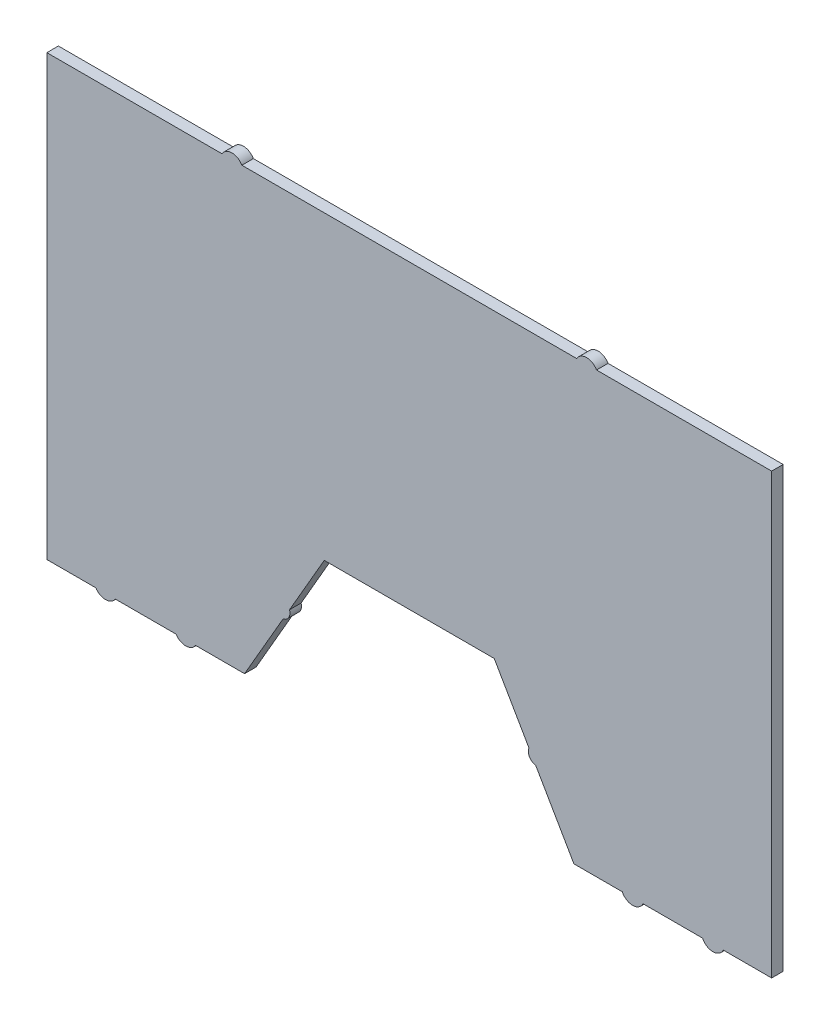
ISO-10303-21;
HEADER;
FILE_DESCRIPTION(('STEP AP214'),'2;1');
FILE_NAME('part.step','',(''),(''),'','','');
FILE_SCHEMA(('AUTOMOTIVE_DESIGN { 1 0 10303 214 1 1 1 1 }'));
ENDSEC;
DATA;
#1=APPLICATION_CONTEXT('core data for automotive mechanical design processes');
#2=APPLICATION_PROTOCOL_DEFINITION('international standard','automotive_design',2000,#1);
#3=PRODUCT_CONTEXT('',#1,'mechanical');
#4=PRODUCT('Part','Part','',(#3));
#5=PRODUCT_RELATED_PRODUCT_CATEGORY('part','',(#4));
#6=PRODUCT_DEFINITION_FORMATION('','',#4);
#7=PRODUCT_DEFINITION_CONTEXT('part definition',#1,'design');
#8=PRODUCT_DEFINITION('design','',#6,#7);
#9=PRODUCT_DEFINITION_SHAPE('','',#8);
#10=(LENGTH_UNIT() NAMED_UNIT(*) SI_UNIT(.MILLI.,.METRE.));
#11=(NAMED_UNIT(*) PLANE_ANGLE_UNIT() SI_UNIT($,.RADIAN.));
#12=(NAMED_UNIT(*) SI_UNIT($,.STERADIAN.) SOLID_ANGLE_UNIT());
#13=UNCERTAINTY_MEASURE_WITH_UNIT(LENGTH_MEASURE(1.E-05),#10,'distance_accuracy_value','');
#14=(GEOMETRIC_REPRESENTATION_CONTEXT(3) GLOBAL_UNCERTAINTY_ASSIGNED_CONTEXT((#13)) GLOBAL_UNIT_ASSIGNED_CONTEXT((#10,
#11,#12)) REPRESENTATION_CONTEXT('',''));
#15=CARTESIAN_POINT('',(0.,0.,0.));
#16=DIRECTION('',(0.,0.,1.));
#17=DIRECTION('',(1.,0.,0.));
#18=AXIS2_PLACEMENT_3D('',#15,#16,#17);
#19=CARTESIAN_POINT('',(-119.213610054364,-38.92969826474,5.));
#20=DIRECTION('',(0.,0.,-1.));
#21=DIRECTION('',(-1.,0.,0.));
#22=AXIS2_PLACEMENT_3D('',#19,#20,#21);
#23=CYLINDRICAL_SURFACE('',#22,4.99999999999952);
#24=CARTESIAN_POINT('',(-119.213610054364,-38.92969826474,0.));
#25=DIRECTION('',(0.,0.,1.));
#26=DIRECTION('',(1.,0.,0.));
#27=AXIS2_PLACEMENT_3D('',#24,#25,#26);
#28=CIRCLE('',#27,4.99999999999952);
#29=CARTESIAN_POINT('',(-123.443790440154,-41.5953265028237,0.));
#30=VERTEX_POINT('',#29);
#31=CARTESIAN_POINT('',(-114.983429668575,-41.5953265028263,0.));
#32=VERTEX_POINT('',#31);
#33=EDGE_CURVE('E225',#30,#32,#28,.T.);
#34=ORIENTED_EDGE('',*,*,#33,.T.);
#35=DIRECTION('',(0.,0.,-1.));
#36=VECTOR('',#35,1.);
#37=CARTESIAN_POINT('',(-114.983429668575,-41.5953265028263,5.));
#38=LINE('',#37,#36);
#39=CARTESIAN_POINT('',(-114.983429668575,-41.5953265028263,5.));
#40=VERTEX_POINT('',#39);
#41=EDGE_CURVE('E11',#40,#32,#38,.T.);
#42=ORIENTED_EDGE('',*,*,#41,.F.);
#43=CARTESIAN_POINT('',(-119.213610054364,-38.92969826474,5.));
#44=DIRECTION('',(0.,0.,1.));
#45=DIRECTION('',(1.,0.,0.));
#46=AXIS2_PLACEMENT_3D('',#43,#44,#45);
#47=CIRCLE('',#46,4.99999999999952);
#48=CARTESIAN_POINT('',(-123.443790440154,-41.5953265028237,5.));
#49=VERTEX_POINT('',#48);
#50=EDGE_CURVE('E271',#49,#40,#47,.T.);
#51=ORIENTED_EDGE('',*,*,#50,.F.);
#52=DIRECTION('',(0.,0.,-1.));
#53=VECTOR('',#52,1.);
#54=CARTESIAN_POINT('',(-123.443790440154,-41.5953265028237,5.));
#55=LINE('',#54,#53);
#56=EDGE_CURVE('E221',#49,#30,#55,.T.);
#57=ORIENTED_EDGE('',*,*,#56,.T.);
#58=EDGE_LOOP('',(#34,#42,#51,#57));
#59=FACE_BOUND('',#58,.T.);
#60=ADVANCED_FACE('F33',(#59),#23,.T.);
#61=CARTESIAN_POINT('',(-114.983429668575,-41.5953265028263,5.));
#62=DIRECTION('',(0.,1.,0.));
#63=DIRECTION('',(-1.,0.,0.));
#64=AXIS2_PLACEMENT_3D('',#61,#62,#63);
#65=PLANE('',#64);
#66=DIRECTION('',(1.,0.,0.));
#67=VECTOR('',#66,1.);
#68=CARTESIAN_POINT('',(-114.983429668575,-41.5953265028263,0.));
#69=LINE('',#68,#67);
#70=CARTESIAN_POINT('',(-88.5527332962316,-41.5953265028267,0.));
#71=VERTEX_POINT('',#70);
#72=EDGE_CURVE('E228',#32,#71,#69,.T.);
#73=ORIENTED_EDGE('',*,*,#72,.T.);
#74=DIRECTION('',(0.,0.,-1.));
#75=VECTOR('',#74,1.);
#76=CARTESIAN_POINT('',(-88.5527332962316,-41.5953265028267,5.));
#77=LINE('',#76,#75);
#78=CARTESIAN_POINT('',(-88.5527332962316,-41.5953265028267,5.));
#79=VERTEX_POINT('',#78);
#80=EDGE_CURVE('E41',#79,#71,#77,.T.);
#81=ORIENTED_EDGE('',*,*,#80,.F.);
#82=DIRECTION('',(1.,0.,0.));
#83=VECTOR('',#82,1.);
#84=CARTESIAN_POINT('',(-114.983429668575,-41.5953265028263,5.));
#85=LINE('',#84,#83);
#86=EDGE_CURVE('E140',#40,#79,#85,.T.);
#87=ORIENTED_EDGE('',*,*,#86,.F.);
#88=ORIENTED_EDGE('',*,*,#41,.T.);
#89=EDGE_LOOP('',(#73,#81,#87,#88));
#90=FACE_BOUND('',#89,.T.);
#91=ADVANCED_FACE('F409',(#90),#65,.F.);
#92=CARTESIAN_POINT('',(-84.3225529104421,-38.92969826474,5.));
#93=DIRECTION('',(0.,0.,-1.));
#94=DIRECTION('',(-1.,0.,0.));
#95=AXIS2_PLACEMENT_3D('',#92,#93,#94);
#96=CYLINDRICAL_SURFACE('',#95,5.00000000000031);
#97=CARTESIAN_POINT('',(-84.3225529104421,-38.92969826474,0.));
#98=DIRECTION('',(0.,0.,1.));
#99=DIRECTION('',(1.,0.,0.));
#100=AXIS2_PLACEMENT_3D('',#97,#98,#99);
#101=CIRCLE('',#100,5.00000000000031);
#102=CARTESIAN_POINT('',(-80.092372524651,-41.5953265028241,0.));
#103=VERTEX_POINT('',#102);
#104=EDGE_CURVE('E230',#71,#103,#101,.T.);
#105=ORIENTED_EDGE('',*,*,#104,.T.);
#106=DIRECTION('',(0.,0.,-1.));
#107=VECTOR('',#106,1.);
#108=CARTESIAN_POINT('',(-80.092372524651,-41.5953265028241,5.));
#109=LINE('',#108,#107);
#110=CARTESIAN_POINT('',(-80.092372524651,-41.5953265028241,5.));
#111=VERTEX_POINT('',#110);
#112=EDGE_CURVE('E326',#111,#103,#109,.T.);
#113=ORIENTED_EDGE('',*,*,#112,.F.);
#114=CARTESIAN_POINT('',(-84.3225529104421,-38.92969826474,5.));
#115=DIRECTION('',(0.,0.,1.));
#116=DIRECTION('',(1.,0.,0.));
#117=AXIS2_PLACEMENT_3D('',#114,#115,#116);
#118=CIRCLE('',#117,5.00000000000031);
#119=EDGE_CURVE('E334',#79,#111,#118,.T.);
#120=ORIENTED_EDGE('',*,*,#119,.F.);
#121=ORIENTED_EDGE('',*,*,#80,.T.);
#122=EDGE_LOOP('',(#105,#113,#120,#121));
#123=FACE_BOUND('',#122,.T.);
#124=ADVANCED_FACE('F332',(#123),#96,.T.);
#125=CARTESIAN_POINT('',(-80.092372524651,-41.5953265028241,5.));
#126=DIRECTION('',(0.,1.,0.));
#127=DIRECTION('',(-1.,0.,0.));
#128=AXIS2_PLACEMENT_3D('',#125,#126,#127);
#129=PLANE('',#128);
#130=DIRECTION('',(1.,0.,0.));
#131=VECTOR('',#130,1.);
#132=CARTESIAN_POINT('',(-80.092372524651,-41.5953265028241,0.));
#133=LINE('',#132,#131);
#134=CARTESIAN_POINT('',(-58.7881518336835,-41.5953265028231,0.));
#135=VERTEX_POINT('',#134);
#136=EDGE_CURVE('E232',#103,#135,#133,.T.);
#137=ORIENTED_EDGE('',*,*,#136,.T.);
#138=DIRECTION('',(0.,0.,-1.));
#139=VECTOR('',#138,1.);
#140=CARTESIAN_POINT('',(-58.7881518336835,-41.5953265028231,5.));
#141=LINE('',#140,#139);
#142=CARTESIAN_POINT('',(-58.7881518336835,-41.5953265028231,5.));
#143=VERTEX_POINT('',#142);
#144=EDGE_CURVE('E323',#143,#135,#141,.T.);
#145=ORIENTED_EDGE('',*,*,#144,.F.);
#146=DIRECTION('',(1.,0.,0.));
#147=VECTOR('',#146,1.);
#148=CARTESIAN_POINT('',(-80.092372524651,-41.5953265028241,5.));
#149=LINE('',#148,#147);
#150=EDGE_CURVE('E352',#111,#143,#149,.T.);
#151=ORIENTED_EDGE('',*,*,#150,.F.);
#152=ORIENTED_EDGE('',*,*,#112,.T.);
#153=EDGE_LOOP('',(#137,#145,#151,#152));
#154=FACE_BOUND('',#153,.T.);
#155=ADVANCED_FACE('F343',(#154),#129,.F.);
#156=CARTESIAN_POINT('',(-58.7881518336835,-41.5953265028231,5.));
#157=DIRECTION('',(-0.866025403784419,0.500000000000034,0.));
#158=DIRECTION('',(-0.500000000000034,-0.866025403784419,0.));
#159=AXIS2_PLACEMENT_3D('',#156,#157,#158);
#160=PLANE('',#159);
#161=DIRECTION('',(0.500000000000034,0.866025403784419,0.));
#162=VECTOR('',#161,1.);
#163=CARTESIAN_POINT('',(-58.7881518336835,-41.5953265028231,0.));
#164=LINE('',#163,#162);
#165=CARTESIAN_POINT('',(-42.0428000798882,-12.5915264746396,0.));
#166=VERTEX_POINT('',#165);
#167=EDGE_CURVE('E234',#135,#166,#164,.T.);
#168=ORIENTED_EDGE('',*,*,#167,.T.);
#169=DIRECTION('',(0.,0.,-1.));
#170=VECTOR('',#169,1.);
#171=CARTESIAN_POINT('',(-42.0428000798882,-12.5915264746396,5.));
#172=LINE('',#171,#170);
#173=CARTESIAN_POINT('',(-42.0428000798882,-12.5915264746396,5.));
#174=VERTEX_POINT('',#173);
#175=EDGE_CURVE('E320',#174,#166,#172,.T.);
#176=ORIENTED_EDGE('',*,*,#175,.F.);
#177=DIRECTION('',(0.500000000000034,0.866025403784419,0.));
#178=VECTOR('',#177,1.);
#179=CARTESIAN_POINT('',(-58.7881518336835,-41.5953265028231,5.));
#180=LINE('',#179,#178);
#181=EDGE_CURVE('E349',#143,#174,#180,.T.);
#182=ORIENTED_EDGE('',*,*,#181,.F.);
#183=ORIENTED_EDGE('',*,*,#144,.T.);
#184=EDGE_LOOP('',(#168,#176,#182,#183));
#185=FACE_BOUND('',#184,.T.);
#186=ADVANCED_FACE('F347',(#185),#160,.F.);
#187=CARTESIAN_POINT('',(-42.8103211034109,-8.9209118832598,5.));
#188=DIRECTION('',(0.,0.,-1.));
#189=DIRECTION('',(-1.,0.,0.));
#190=AXIS2_PLACEMENT_3D('',#187,#188,#189);
#191=CYLINDRICAL_SURFACE('',#190,3.74999999999997);
#192=CARTESIAN_POINT('',(-42.8103211034109,-8.9209118832598,0.));
#193=DIRECTION('',(0.,0.,1.));
#194=DIRECTION('',(1.,0.,0.));
#195=AXIS2_PLACEMENT_3D('',#192,#193,#194);
#196=CIRCLE('',#195,3.74999999999997);
#197=CARTESIAN_POINT('',(-39.2477151080128,-7.75029729187918,0.));
#198=VERTEX_POINT('',#197);
#199=EDGE_CURVE('E236',#166,#198,#196,.T.);
#200=ORIENTED_EDGE('',*,*,#199,.T.);
#201=DIRECTION('',(0.,0.,-1.));
#202=VECTOR('',#201,1.);
#203=CARTESIAN_POINT('',(-39.2477151080128,-7.75029729187918,5.));
#204=LINE('',#203,#202);
#205=CARTESIAN_POINT('',(-39.2477151080128,-7.75029729187918,5.));
#206=VERTEX_POINT('',#205);
#207=EDGE_CURVE('E317',#206,#198,#204,.T.);
#208=ORIENTED_EDGE('',*,*,#207,.F.);
#209=CARTESIAN_POINT('',(-42.8103211034109,-8.9209118832598,5.));
#210=DIRECTION('',(0.,0.,1.));
#211=DIRECTION('',(1.,0.,0.));
#212=AXIS2_PLACEMENT_3D('',#209,#210,#211);
#213=CIRCLE('',#212,3.74999999999997);
#214=EDGE_CURVE('E351',#174,#206,#213,.T.);
#215=ORIENTED_EDGE('',*,*,#214,.F.);
#216=ORIENTED_EDGE('',*,*,#175,.T.);
#217=EDGE_LOOP('',(#200,#208,#215,#216));
#218=FACE_BOUND('',#217,.T.);
#219=ADVANCED_FACE('F422',(#218),#191,.T.);
#220=CARTESIAN_POINT('',(-39.2477151080128,-7.75029729187918,5.));
#221=DIRECTION('',(-0.866025403784439,0.5,0.));
#222=DIRECTION('',(-0.5,-0.866025403784439,0.));
#223=AXIS2_PLACEMENT_3D('',#220,#221,#222);
#224=PLANE('',#223);
#225=DIRECTION('',(0.5,0.866025403784439,0.));
#226=VECTOR('',#225,1.);
#227=CARTESIAN_POINT('',(-39.2477151080128,-7.75029729187918,0.));
#228=LINE('',#227,#226);
#229=CARTESIAN_POINT('',(-24.1471356823104,18.4046734971667,0.));
#230=VERTEX_POINT('',#229);
#231=EDGE_CURVE('E238',#198,#230,#228,.T.);
#232=ORIENTED_EDGE('',*,*,#231,.T.);
#233=DIRECTION('',(0.,0.,-1.));
#234=VECTOR('',#233,1.);
#235=CARTESIAN_POINT('',(-24.1471356823104,18.4046734971667,5.));
#236=LINE('',#235,#234);
#237=CARTESIAN_POINT('',(-24.1471356823104,18.4046734971667,5.));
#238=VERTEX_POINT('',#237);
#239=EDGE_CURVE('E314',#238,#230,#236,.T.);
#240=ORIENTED_EDGE('',*,*,#239,.F.);
#241=DIRECTION('',(0.5,0.866025403784439,0.));
#242=VECTOR('',#241,1.);
#243=CARTESIAN_POINT('',(-39.2477151080128,-7.75029729187918,5.));
#244=LINE('',#243,#242);
#245=EDGE_CURVE('E354',#206,#238,#244,.T.);
#246=ORIENTED_EDGE('',*,*,#245,.F.);
#247=ORIENTED_EDGE('',*,*,#207,.T.);
#248=EDGE_LOOP('',(#232,#240,#246,#247));
#249=FACE_BOUND('',#248,.T.);
#250=ADVANCED_FACE('F425',(#249),#224,.F.);
#251=CARTESIAN_POINT('',(-24.1471356823104,18.4046734971667,5.));
#252=DIRECTION('',(0.,1.,0.));
#253=DIRECTION('',(-1.,0.,0.));
#254=AXIS2_PLACEMENT_3D('',#251,#252,#253);
#255=PLANE('',#254);
#256=DIRECTION('',(1.,0.,0.));
#257=VECTOR('',#256,1.);
#258=CARTESIAN_POINT('',(-24.1471356823104,18.4046734971667,0.));
#259=LINE('',#258,#257);
#260=CARTESIAN_POINT('',(49.7536987739743,18.4046734971667,0.));
#261=VERTEX_POINT('',#260);
#262=EDGE_CURVE('E240',#230,#261,#259,.T.);
#263=ORIENTED_EDGE('',*,*,#262,.T.);
#264=DIRECTION('',(0.,0.,-1.));
#265=VECTOR('',#264,1.);
#266=CARTESIAN_POINT('',(49.7536987739743,18.4046734971667,5.));
#267=LINE('',#266,#265);
#268=CARTESIAN_POINT('',(49.7536987739743,18.4046734971667,5.));
#269=VERTEX_POINT('',#268);
#270=EDGE_CURVE('E311',#269,#261,#267,.T.);
#271=ORIENTED_EDGE('',*,*,#270,.F.);
#272=DIRECTION('',(1.,0.,0.));
#273=VECTOR('',#272,1.);
#274=CARTESIAN_POINT('',(-24.1471356823104,18.4046734971667,5.));
#275=LINE('',#274,#273);
#276=EDGE_CURVE('E360',#238,#269,#275,.T.);
#277=ORIENTED_EDGE('',*,*,#276,.F.);
#278=ORIENTED_EDGE('',*,*,#239,.T.);
#279=EDGE_LOOP('',(#263,#271,#277,#278));
#280=FACE_BOUND('',#279,.T.);
#281=ADVANCED_FACE('F429',(#280),#255,.F.);
#282=CARTESIAN_POINT('',(49.7536987739743,18.4046734971667,5.));
#283=DIRECTION('',(0.866025403784439,0.5,0.));
#284=DIRECTION('',(-0.5,0.866025403784439,0.));
#285=AXIS2_PLACEMENT_3D('',#282,#283,#284);
#286=PLANE('',#285);
#287=DIRECTION('',(0.5,-0.866025403784439,0.));
#288=VECTOR('',#287,1.);
#289=CARTESIAN_POINT('',(49.7536987739743,18.4046734971667,0.));
#290=LINE('',#289,#288);
#291=CARTESIAN_POINT('',(64.8430984024138,-7.73093331500135,0.));
#292=VERTEX_POINT('',#291);
#293=EDGE_CURVE('E242',#261,#292,#290,.T.);
#294=ORIENTED_EDGE('',*,*,#293,.T.);
#295=DIRECTION('',(0.,0.,-1.));
#296=VECTOR('',#295,1.);
#297=CARTESIAN_POINT('',(64.8430984024138,-7.73093331500135,5.));
#298=LINE('',#297,#296);
#299=CARTESIAN_POINT('',(64.8430984024138,-7.73093331500135,5.));
#300=VERTEX_POINT('',#299);
#301=EDGE_CURVE('E308',#300,#292,#298,.T.);
#302=ORIENTED_EDGE('',*,*,#301,.F.);
#303=DIRECTION('',(0.5,-0.866025403784439,0.));
#304=VECTOR('',#303,1.);
#305=CARTESIAN_POINT('',(49.7536987739743,18.4046734971667,5.));
#306=LINE('',#305,#304);
#307=EDGE_CURVE('E362',#269,#300,#306,.T.);
#308=ORIENTED_EDGE('',*,*,#307,.F.);
#309=ORIENTED_EDGE('',*,*,#270,.T.);
#310=EDGE_LOOP('',(#294,#302,#308,#309));
#311=FACE_BOUND('',#310,.T.);
#312=ADVANCED_FACE('F433',(#311),#286,.F.);
#313=CARTESIAN_POINT('',(68.3247668039712,-9.12394628751689,5.));
#314=DIRECTION('',(0.,0.,-1.));
#315=DIRECTION('',(-1.,0.,0.));
#316=AXIS2_PLACEMENT_3D('',#313,#314,#315);
#317=CYLINDRICAL_SURFACE('',#316,3.74999999999998);
#318=CARTESIAN_POINT('',(68.3247668039712,-9.12394628751689,0.));
#319=DIRECTION('',(0.,0.,1.));
#320=DIRECTION('',(1.,0.,0.));
#321=AXIS2_PLACEMENT_3D('',#318,#319,#320);
#322=CIRCLE('',#321,3.74999999999998);
#323=CARTESIAN_POINT('',(67.7903172251915,-12.8356660570768,0.));
#324=VERTEX_POINT('',#323);
#325=EDGE_CURVE('E244',#292,#324,#322,.T.);
#326=ORIENTED_EDGE('',*,*,#325,.T.);
#327=DIRECTION('',(0.,0.,-1.));
#328=VECTOR('',#327,1.);
#329=CARTESIAN_POINT('',(67.7903172251915,-12.8356660570768,5.));
#330=LINE('',#329,#328);
#331=CARTESIAN_POINT('',(67.7903172251915,-12.8356660570768,5.));
#332=VERTEX_POINT('',#331);
#333=EDGE_CURVE('E305',#332,#324,#330,.T.);
#334=ORIENTED_EDGE('',*,*,#333,.F.);
#335=CARTESIAN_POINT('',(68.3247668039712,-9.12394628751689,5.));
#336=DIRECTION('',(0.,0.,1.));
#337=DIRECTION('',(1.,0.,0.));
#338=AXIS2_PLACEMENT_3D('',#335,#336,#337);
#339=CIRCLE('',#338,3.74999999999998);
#340=EDGE_CURVE('E364',#300,#332,#339,.T.);
#341=ORIENTED_EDGE('',*,*,#340,.F.);
#342=ORIENTED_EDGE('',*,*,#301,.T.);
#343=EDGE_LOOP('',(#326,#334,#341,#342));
#344=FACE_BOUND('',#343,.T.);
#345=ADVANCED_FACE('F437',(#344),#317,.T.);
#346=CARTESIAN_POINT('',(67.7903172251915,-12.8356660570768,5.));
#347=DIRECTION('',(0.866025403784438,0.5,0.));
#348=DIRECTION('',(-0.5,0.866025403784439,0.));
#349=AXIS2_PLACEMENT_3D('',#346,#347,#348);
#350=PLANE('',#349);
#351=DIRECTION('',(0.5,-0.866025403784438,0.));
#352=VECTOR('',#351,1.);
#353=CARTESIAN_POINT('',(67.7903172251915,-12.8356660570768,0.));
#354=LINE('',#353,#352);
#355=CARTESIAN_POINT('',(84.3947149253511,-41.5953265028332,0.));
#356=VERTEX_POINT('',#355);
#357=EDGE_CURVE('E246',#324,#356,#354,.T.);
#358=ORIENTED_EDGE('',*,*,#357,.T.);
#359=DIRECTION('',(0.,0.,-1.));
#360=VECTOR('',#359,1.);
#361=CARTESIAN_POINT('',(84.3947149253511,-41.5953265028332,5.));
#362=LINE('',#361,#360);
#363=CARTESIAN_POINT('',(84.3947149253511,-41.5953265028332,5.));
#364=VERTEX_POINT('',#363);
#365=EDGE_CURVE('E302',#364,#356,#362,.T.);
#366=ORIENTED_EDGE('',*,*,#365,.F.);
#367=DIRECTION('',(0.5,-0.866025403784438,0.));
#368=VECTOR('',#367,1.);
#369=CARTESIAN_POINT('',(67.7903172251915,-12.8356660570768,5.));
#370=LINE('',#369,#368);
#371=EDGE_CURVE('E366',#332,#364,#370,.T.);
#372=ORIENTED_EDGE('',*,*,#371,.F.);
#373=ORIENTED_EDGE('',*,*,#333,.T.);
#374=EDGE_LOOP('',(#358,#366,#372,#373));
#375=FACE_BOUND('',#374,.T.);
#376=ADVANCED_FACE('F441',(#375),#350,.F.);
#377=CARTESIAN_POINT('',(84.3947149253511,-41.5953265028332,5.));
#378=DIRECTION('',(0.,1.,0.));
#379=DIRECTION('',(0.,0.,1.));
#380=AXIS2_PLACEMENT_3D('',#377,#378,#379);
#381=PLANE('',#380);
#382=DIRECTION('',(1.,0.,0.));
#383=VECTOR('',#382,1.);
#384=CARTESIAN_POINT('',(84.3947149253511,-41.5953265028332,0.));
#385=LINE('',#384,#383);
#386=CARTESIAN_POINT('',(105.408163944737,-41.5953265028332,0.));
#387=VERTEX_POINT('',#386);
#388=EDGE_CURVE('E248',#356,#387,#385,.T.);
#389=ORIENTED_EDGE('',*,*,#388,.T.);
#390=DIRECTION('',(0.,0.,-1.));
#391=VECTOR('',#390,1.);
#392=CARTESIAN_POINT('',(105.408163944737,-41.5953265028332,5.));
#393=LINE('',#392,#391);
#394=CARTESIAN_POINT('',(105.408163944737,-41.5953265028332,5.));
#395=VERTEX_POINT('',#394);
#396=EDGE_CURVE('E299',#395,#387,#393,.T.);
#397=ORIENTED_EDGE('',*,*,#396,.F.);
#398=DIRECTION('',(1.,0.,0.));
#399=VECTOR('',#398,1.);
#400=CARTESIAN_POINT('',(84.3947149253511,-41.5953265028332,5.));
#401=LINE('',#400,#399);
#402=EDGE_CURVE('E368',#364,#395,#401,.T.);
#403=ORIENTED_EDGE('',*,*,#402,.F.);
#404=ORIENTED_EDGE('',*,*,#365,.T.);
#405=EDGE_LOOP('',(#389,#397,#403,#404));
#406=FACE_BOUND('',#405,.T.);
#407=ADVANCED_FACE('F445',(#406),#381,.F.);
#408=CARTESIAN_POINT('',(109.92828154584,-39.4579129087436,5.));
#409=DIRECTION('',(0.,0.,-1.));
#410=DIRECTION('',(-1.,0.,0.));
#411=AXIS2_PLACEMENT_3D('',#408,#409,#410);
#412=CYLINDRICAL_SURFACE('',#411,5.);
#413=CARTESIAN_POINT('',(109.92828154584,-39.4579129087436,0.));
#414=DIRECTION('',(0.,0.,1.));
#415=DIRECTION('',(1.,0.,0.));
#416=AXIS2_PLACEMENT_3D('',#413,#414,#415);
#417=CIRCLE('',#416,5.);
#418=CARTESIAN_POINT('',(114.448399146943,-41.5953265028332,0.));
#419=VERTEX_POINT('',#418);
#420=EDGE_CURVE('E250',#387,#419,#417,.T.);
#421=ORIENTED_EDGE('',*,*,#420,.T.);
#422=DIRECTION('',(0.,0.,-1.));
#423=VECTOR('',#422,1.);
#424=CARTESIAN_POINT('',(114.448399146943,-41.5953265028332,5.));
#425=LINE('',#424,#423);
#426=CARTESIAN_POINT('',(114.448399146943,-41.5953265028332,5.));
#427=VERTEX_POINT('',#426);
#428=EDGE_CURVE('E296',#427,#419,#425,.T.);
#429=ORIENTED_EDGE('',*,*,#428,.F.);
#430=CARTESIAN_POINT('',(109.92828154584,-39.4579129087436,5.));
#431=DIRECTION('',(0.,0.,1.));
#432=DIRECTION('',(1.,0.,0.));
#433=AXIS2_PLACEMENT_3D('',#430,#431,#432);
#434=CIRCLE('',#433,5.);
#435=EDGE_CURVE('E370',#395,#427,#434,.T.);
#436=ORIENTED_EDGE('',*,*,#435,.F.);
#437=ORIENTED_EDGE('',*,*,#396,.T.);
#438=EDGE_LOOP('',(#421,#429,#436,#437));
#439=FACE_BOUND('',#438,.T.);
#440=ADVANCED_FACE('F449',(#439),#412,.T.);
#441=CARTESIAN_POINT('',(114.448399146943,-41.5953265028332,5.));
#442=DIRECTION('',(0.,1.,0.));
#443=DIRECTION('',(0.,0.,1.));
#444=AXIS2_PLACEMENT_3D('',#441,#442,#443);
#445=PLANE('',#444);
#446=DIRECTION('',(1.,0.,0.));
#447=VECTOR('',#446,1.);
#448=CARTESIAN_POINT('',(114.448399146943,-41.5953265028332,0.));
#449=LINE('',#448,#447);
#450=CARTESIAN_POINT('',(140.300890001201,-41.5953265028332,0.));
#451=VERTEX_POINT('',#450);
#452=EDGE_CURVE('E252',#419,#451,#449,.T.);
#453=ORIENTED_EDGE('',*,*,#452,.T.);
#454=DIRECTION('',(0.,0.,-1.));
#455=VECTOR('',#454,1.);
#456=CARTESIAN_POINT('',(140.300890001201,-41.5953265028332,5.));
#457=LINE('',#456,#455);
#458=CARTESIAN_POINT('',(140.300890001201,-41.5953265028332,5.));
#459=VERTEX_POINT('',#458);
#460=EDGE_CURVE('E293',#459,#451,#457,.T.);
#461=ORIENTED_EDGE('',*,*,#460,.F.);
#462=DIRECTION('',(1.,0.,0.));
#463=VECTOR('',#462,1.);
#464=CARTESIAN_POINT('',(114.448399146943,-41.5953265028332,5.));
#465=LINE('',#464,#463);
#466=EDGE_CURVE('E372',#427,#459,#465,.T.);
#467=ORIENTED_EDGE('',*,*,#466,.F.);
#468=ORIENTED_EDGE('',*,*,#428,.T.);
#469=EDGE_LOOP('',(#453,#461,#467,#468));
#470=FACE_BOUND('',#469,.T.);
#471=ADVANCED_FACE('F453',(#470),#445,.F.);
#472=CARTESIAN_POINT('',(144.821007602304,-39.4579129087436,5.));
#473=DIRECTION('',(0.,0.,-1.));
#474=DIRECTION('',(-1.,0.,0.));
#475=AXIS2_PLACEMENT_3D('',#472,#473,#474);
#476=CYLINDRICAL_SURFACE('',#475,4.99999999999997);
#477=CARTESIAN_POINT('',(144.821007602304,-39.4579129087436,0.));
#478=DIRECTION('',(0.,0.,1.));
#479=DIRECTION('',(1.,0.,0.));
#480=AXIS2_PLACEMENT_3D('',#477,#478,#479);
#481=CIRCLE('',#480,4.99999999999997);
#482=CARTESIAN_POINT('',(149.341125203407,-41.5953265028332,0.));
#483=VERTEX_POINT('',#482);
#484=EDGE_CURVE('E254',#451,#483,#481,.T.);
#485=ORIENTED_EDGE('',*,*,#484,.T.);
#486=DIRECTION('',(0.,0.,-1.));
#487=VECTOR('',#486,1.);
#488=CARTESIAN_POINT('',(149.341125203407,-41.5953265028332,5.));
#489=LINE('',#488,#487);
#490=CARTESIAN_POINT('',(149.341125203407,-41.5953265028332,5.));
#491=VERTEX_POINT('',#490);
#492=EDGE_CURVE('E290',#491,#483,#489,.T.);
#493=ORIENTED_EDGE('',*,*,#492,.F.);
#494=CARTESIAN_POINT('',(144.821007602304,-39.4579129087436,5.));
#495=DIRECTION('',(0.,0.,1.));
#496=DIRECTION('',(1.,0.,0.));
#497=AXIS2_PLACEMENT_3D('',#494,#495,#496);
#498=CIRCLE('',#497,4.99999999999997);
#499=EDGE_CURVE('E374',#459,#491,#498,.T.);
#500=ORIENTED_EDGE('',*,*,#499,.F.);
#501=ORIENTED_EDGE('',*,*,#460,.T.);
#502=EDGE_LOOP('',(#485,#493,#500,#501));
#503=FACE_BOUND('',#502,.T.);
#504=ADVANCED_FACE('F457',(#503),#476,.T.);
#505=CARTESIAN_POINT('',(149.341125203407,-41.5953265028332,5.));
#506=DIRECTION('',(0.,1.,0.));
#507=DIRECTION('',(-1.,0.,0.));
#508=AXIS2_PLACEMENT_3D('',#505,#506,#507);
#509=PLANE('',#508);
#510=DIRECTION('',(1.,0.,0.));
#511=VECTOR('',#510,1.);
#512=CARTESIAN_POINT('',(149.341125203407,-41.5953265028332,0.));
#513=LINE('',#512,#511);
#514=CARTESIAN_POINT('',(170.354574222792,-41.5953265028332,0.));
#515=VERTEX_POINT('',#514);
#516=EDGE_CURVE('E256',#483,#515,#513,.T.);
#517=ORIENTED_EDGE('',*,*,#516,.T.);
#518=DIRECTION('',(0.,0.,-1.));
#519=VECTOR('',#518,1.);
#520=CARTESIAN_POINT('',(170.354574222792,-41.5953265028332,5.));
#521=LINE('',#520,#519);
#522=CARTESIAN_POINT('',(170.354574222792,-41.5953265028332,5.));
#523=VERTEX_POINT('',#522);
#524=EDGE_CURVE('E287',#523,#515,#521,.T.);
#525=ORIENTED_EDGE('',*,*,#524,.F.);
#526=DIRECTION('',(1.,0.,0.));
#527=VECTOR('',#526,1.);
#528=CARTESIAN_POINT('',(149.341125203407,-41.5953265028332,5.));
#529=LINE('',#528,#527);
#530=EDGE_CURVE('E376',#491,#523,#529,.T.);
#531=ORIENTED_EDGE('',*,*,#530,.F.);
#532=ORIENTED_EDGE('',*,*,#492,.T.);
#533=EDGE_LOOP('',(#517,#525,#531,#532));
#534=FACE_BOUND('',#533,.T.);
#535=ADVANCED_FACE('F461',(#534),#509,.F.);
#536=CARTESIAN_POINT('',(170.354574222792,-41.5953265028332,5.));
#537=DIRECTION('',(-1.,0.,0.));
#538=DIRECTION('',(0.,-1.,0.));
#539=AXIS2_PLACEMENT_3D('',#536,#537,#538);
#540=PLANE('',#539);
#541=DIRECTION('',(0.,1.,0.));
#542=VECTOR('',#541,1.);
#543=CARTESIAN_POINT('',(170.354574222792,-41.5953265028332,0.));
#544=LINE('',#543,#542);
#545=CARTESIAN_POINT('',(170.35457422279,149.258117984475,0.));
#546=VERTEX_POINT('',#545);
#547=EDGE_CURVE('E258',#515,#546,#544,.T.);
#548=ORIENTED_EDGE('',*,*,#547,.T.);
#549=DIRECTION('',(0.,0.,-1.));
#550=VECTOR('',#549,1.);
#551=CARTESIAN_POINT('',(170.35457422279,149.258117984475,5.));
#552=LINE('',#551,#550);
#553=CARTESIAN_POINT('',(170.35457422279,149.258117984475,5.));
#554=VERTEX_POINT('',#553);
#555=EDGE_CURVE('E284',#554,#546,#552,.T.);
#556=ORIENTED_EDGE('',*,*,#555,.F.);
#557=DIRECTION('',(0.,1.,0.));
#558=VECTOR('',#557,1.);
#559=CARTESIAN_POINT('',(170.354574222792,-41.5953265028332,5.));
#560=LINE('',#559,#558);
#561=EDGE_CURVE('E378',#523,#554,#560,.T.);
#562=ORIENTED_EDGE('',*,*,#561,.F.);
#563=ORIENTED_EDGE('',*,*,#524,.T.);
#564=EDGE_LOOP('',(#548,#556,#562,#563));
#565=FACE_BOUND('',#564,.T.);
#566=ADVANCED_FACE('F465',(#565),#540,.F.);
#567=CARTESIAN_POINT('',(170.35457422279,149.258117984475,5.));
#568=DIRECTION('',(0.,-1.,0.));
#569=DIRECTION('',(0.,0.,-1.));
#570=AXIS2_PLACEMENT_3D('',#567,#568,#569);
#571=PLANE('',#570);
#572=DIRECTION('',(-1.,0.,0.));
#573=VECTOR('',#572,1.);
#574=CARTESIAN_POINT('',(170.35457422279,149.258117984475,0.));
#575=LINE('',#574,#573);
#576=CARTESIAN_POINT('',(94.2344207758552,149.258117984475,0.));
#577=VERTEX_POINT('',#576);
#578=EDGE_CURVE('E260',#546,#577,#575,.T.);
#579=ORIENTED_EDGE('',*,*,#578,.T.);
#580=DIRECTION('',(0.,0.,-1.));
#581=VECTOR('',#580,1.);
#582=CARTESIAN_POINT('',(94.2344207758552,149.258117984475,5.));
#583=LINE('',#582,#581);
#584=CARTESIAN_POINT('',(94.2344207758552,149.258117984475,5.));
#585=VERTEX_POINT('',#584);
#586=EDGE_CURVE('E281',#585,#577,#583,.T.);
#587=ORIENTED_EDGE('',*,*,#586,.F.);
#588=DIRECTION('',(-1.,0.,0.));
#589=VECTOR('',#588,1.);
#590=CARTESIAN_POINT('',(170.35457422279,149.258117984475,5.));
#591=LINE('',#590,#589);
#592=EDGE_CURVE('E380',#554,#585,#591,.T.);
#593=ORIENTED_EDGE('',*,*,#592,.F.);
#594=ORIENTED_EDGE('',*,*,#555,.T.);
#595=EDGE_LOOP('',(#579,#587,#593,#594));
#596=FACE_BOUND('',#595,.T.);
#597=ADVANCED_FACE('F469',(#596),#571,.F.);
#598=CARTESIAN_POINT('',(89.904293756933,146.758117984475,5.));
#599=DIRECTION('',(0.,0.,-1.));
#600=DIRECTION('',(-1.,0.,0.));
#601=AXIS2_PLACEMENT_3D('',#598,#599,#600);
#602=CYLINDRICAL_SURFACE('',#601,4.99999999999999);
#603=CARTESIAN_POINT('',(89.904293756933,146.758117984475,0.));
#604=DIRECTION('',(0.,0.,1.));
#605=DIRECTION('',(1.,0.,0.));
#606=AXIS2_PLACEMENT_3D('',#603,#604,#605);
#607=CIRCLE('',#606,4.99999999999999);
#608=CARTESIAN_POINT('',(85.5741667380109,149.258117984475,0.));
#609=VERTEX_POINT('',#608);
#610=EDGE_CURVE('E262',#577,#609,#607,.T.);
#611=ORIENTED_EDGE('',*,*,#610,.T.);
#612=DIRECTION('',(0.,0.,-1.));
#613=VECTOR('',#612,1.);
#614=CARTESIAN_POINT('',(85.5741667380109,149.258117984475,5.));
#615=LINE('',#614,#613);
#616=CARTESIAN_POINT('',(85.5741667380109,149.258117984475,5.));
#617=VERTEX_POINT('',#616);
#618=EDGE_CURVE('E278',#617,#609,#615,.T.);
#619=ORIENTED_EDGE('',*,*,#618,.F.);
#620=CARTESIAN_POINT('',(89.904293756933,146.758117984475,5.));
#621=DIRECTION('',(0.,0.,1.));
#622=DIRECTION('',(1.,0.,0.));
#623=AXIS2_PLACEMENT_3D('',#620,#621,#622);
#624=CIRCLE('',#623,4.99999999999999);
#625=EDGE_CURVE('E382',#585,#617,#624,.T.);
#626=ORIENTED_EDGE('',*,*,#625,.F.);
#627=ORIENTED_EDGE('',*,*,#586,.T.);
#628=EDGE_LOOP('',(#611,#619,#626,#627));
#629=FACE_BOUND('',#628,.T.);
#630=ADVANCED_FACE('F473',(#629),#602,.T.);
#631=CARTESIAN_POINT('',(85.5741667380109,149.258117984475,5.));
#632=DIRECTION('',(0.,-1.,0.));
#633=DIRECTION('',(0.,0.,-1.));
#634=AXIS2_PLACEMENT_3D('',#631,#632,#633);
#635=PLANE('',#634);
#636=DIRECTION('',(-1.,0.,0.));
#637=VECTOR('',#636,1.);
#638=CARTESIAN_POINT('',(85.5741667380109,149.258117984475,0.));
#639=LINE('',#638,#637);
#640=CARTESIAN_POINT('',(-59.9675101577284,149.258117984475,0.));
#641=VERTEX_POINT('',#640);
#642=EDGE_CURVE('E264',#609,#641,#639,.T.);
#643=ORIENTED_EDGE('',*,*,#642,.T.);
#644=DIRECTION('',(0.,0.,-1.));
#645=VECTOR('',#644,1.);
#646=CARTESIAN_POINT('',(-59.9675101577284,149.258117984475,5.));
#647=LINE('',#646,#645);
#648=CARTESIAN_POINT('',(-59.9675101577284,149.258117984475,5.));
#649=VERTEX_POINT('',#648);
#650=EDGE_CURVE('E275',#649,#641,#647,.T.);
#651=ORIENTED_EDGE('',*,*,#650,.F.);
#652=DIRECTION('',(-1.,0.,0.));
#653=VECTOR('',#652,1.);
#654=CARTESIAN_POINT('',(85.5741667380109,149.258117984475,5.));
#655=LINE('',#654,#653);
#656=EDGE_CURVE('E384',#617,#649,#655,.T.);
#657=ORIENTED_EDGE('',*,*,#656,.F.);
#658=ORIENTED_EDGE('',*,*,#618,.T.);
#659=EDGE_LOOP('',(#643,#651,#657,#658));
#660=FACE_BOUND('',#659,.T.);
#661=ADVANCED_FACE('F390',(#660),#635,.F.);
#662=CARTESIAN_POINT('',(-64.2976371766506,146.758117984475,5.));
#663=DIRECTION('',(0.,0.,-1.));
#664=DIRECTION('',(-1.,0.,0.));
#665=AXIS2_PLACEMENT_3D('',#662,#663,#664);
#666=CYLINDRICAL_SURFACE('',#665,5.00000000000001);
#667=CARTESIAN_POINT('',(-64.2976371766506,146.758117984475,0.));
#668=DIRECTION('',(0.,0.,1.));
#669=DIRECTION('',(1.,0.,0.));
#670=AXIS2_PLACEMENT_3D('',#667,#668,#669);
#671=CIRCLE('',#670,5.00000000000001);
#672=CARTESIAN_POINT('',(-68.6277641955729,149.258117984475,0.));
#673=VERTEX_POINT('',#672);
#674=EDGE_CURVE('E266',#641,#673,#671,.T.);
#675=ORIENTED_EDGE('',*,*,#674,.T.);
#676=DIRECTION('',(0.,0.,-1.));
#677=VECTOR('',#676,1.);
#678=CARTESIAN_POINT('',(-68.6277641955729,149.258117984475,5.));
#679=LINE('',#678,#677);
#680=CARTESIAN_POINT('',(-68.6277641955729,149.258117984475,5.));
#681=VERTEX_POINT('',#680);
#682=EDGE_CURVE('E216',#681,#673,#679,.T.);
#683=ORIENTED_EDGE('',*,*,#682,.F.);
#684=CARTESIAN_POINT('',(-64.2976371766506,146.758117984475,5.));
#685=DIRECTION('',(0.,0.,1.));
#686=DIRECTION('',(1.,0.,0.));
#687=AXIS2_PLACEMENT_3D('',#684,#685,#686);
#688=CIRCLE('',#687,5.00000000000001);
#689=EDGE_CURVE('E207',#649,#681,#688,.T.);
#690=ORIENTED_EDGE('',*,*,#689,.F.);
#691=ORIENTED_EDGE('',*,*,#650,.T.);
#692=EDGE_LOOP('',(#675,#683,#690,#691));
#693=FACE_BOUND('',#692,.T.);
#694=ADVANCED_FACE('F394',(#693),#666,.T.);
#695=CARTESIAN_POINT('',(-68.6277641955729,149.258117984475,5.));
#696=DIRECTION('',(0.,-1.,0.));
#697=DIRECTION('',(0.,0.,-1.));
#698=AXIS2_PLACEMENT_3D('',#695,#696,#697);
#699=PLANE('',#698);
#700=DIRECTION('',(-1.,0.,0.));
#701=VECTOR('',#700,1.);
#702=CARTESIAN_POINT('',(-68.6277641955729,149.258117984475,0.));
#703=LINE('',#702,#701);
#704=CARTESIAN_POINT('',(-144.748011131123,149.258117984475,0.));
#705=VERTEX_POINT('',#704);
#706=EDGE_CURVE('E215',#673,#705,#703,.T.);
#707=ORIENTED_EDGE('',*,*,#706,.T.);
#708=DIRECTION('',(0.,0.,-1.));
#709=VECTOR('',#708,1.);
#710=CARTESIAN_POINT('',(-144.748011131123,149.258117984475,5.));
#711=LINE('',#710,#709);
#712=CARTESIAN_POINT('',(-144.748011131123,149.258117984475,5.));
#713=VERTEX_POINT('',#712);
#714=EDGE_CURVE('E212',#713,#705,#711,.T.);
#715=ORIENTED_EDGE('',*,*,#714,.F.);
#716=DIRECTION('',(-1.,0.,0.));
#717=VECTOR('',#716,1.);
#718=CARTESIAN_POINT('',(-68.6277641955729,149.258117984475,5.));
#719=LINE('',#718,#717);
#720=EDGE_CURVE('E201',#681,#713,#719,.T.);
#721=ORIENTED_EDGE('',*,*,#720,.F.);
#722=ORIENTED_EDGE('',*,*,#682,.T.);
#723=EDGE_LOOP('',(#707,#715,#721,#722));
#724=FACE_BOUND('',#723,.T.);
#725=ADVANCED_FACE('F213',(#724),#699,.F.);
#726=CARTESIAN_POINT('',(-144.748011131123,149.258117984475,5.));
#727=DIRECTION('',(1.,0.,0.));
#728=DIRECTION('',(0.,1.,0.));
#729=AXIS2_PLACEMENT_3D('',#726,#727,#728);
#730=PLANE('',#729);
#731=DIRECTION('',(0.,-1.,0.));
#732=VECTOR('',#731,1.);
#733=CARTESIAN_POINT('',(-144.748011131123,149.258117984475,0.));
#734=LINE('',#733,#732);
#735=CARTESIAN_POINT('',(-144.748011131123,-41.5953265028256,0.));
#736=VERTEX_POINT('',#735);
#737=EDGE_CURVE('E126',#705,#736,#734,.T.);
#738=ORIENTED_EDGE('',*,*,#737,.T.);
#739=DIRECTION('',(0.,0.,-1.));
#740=VECTOR('',#739,1.);
#741=CARTESIAN_POINT('',(-144.748011131123,-41.5953265028256,5.));
#742=LINE('',#741,#740);
#743=CARTESIAN_POINT('',(-144.748011131123,-41.5953265028256,5.));
#744=VERTEX_POINT('',#743);
#745=EDGE_CURVE('E217',#744,#736,#742,.T.);
#746=ORIENTED_EDGE('',*,*,#745,.F.);
#747=DIRECTION('',(0.,-1.,0.));
#748=VECTOR('',#747,1.);
#749=CARTESIAN_POINT('',(-144.748011131123,149.258117984475,5.));
#750=LINE('',#749,#748);
#751=EDGE_CURVE('E205',#713,#744,#750,.T.);
#752=ORIENTED_EDGE('',*,*,#751,.F.);
#753=ORIENTED_EDGE('',*,*,#714,.T.);
#754=EDGE_LOOP('',(#738,#746,#752,#753));
#755=FACE_BOUND('',#754,.T.);
#756=ADVANCED_FACE('F219',(#755),#730,.F.);
#757=CARTESIAN_POINT('',(-144.748011131123,-41.5953265028256,5.));
#758=DIRECTION('',(0.,1.,0.));
#759=DIRECTION('',(-1.,0.,0.));
#760=AXIS2_PLACEMENT_3D('',#757,#758,#759);
#761=PLANE('',#760);
#762=DIRECTION('',(1.,0.,0.));
#763=VECTOR('',#762,1.);
#764=CARTESIAN_POINT('',(-144.748011131123,-41.5953265028256,0.));
#765=LINE('',#764,#763);
#766=EDGE_CURVE('E132',#736,#30,#765,.T.);
#767=ORIENTED_EDGE('',*,*,#766,.T.);
#768=ORIENTED_EDGE('',*,*,#56,.F.);
#769=DIRECTION('',(1.,0.,0.));
#770=VECTOR('',#769,1.);
#771=CARTESIAN_POINT('',(-144.748011131123,-41.5953265028256,5.));
#772=LINE('',#771,#770);
#773=EDGE_CURVE('E49',#744,#49,#772,.T.);
#774=ORIENTED_EDGE('',*,*,#773,.F.);
#775=ORIENTED_EDGE('',*,*,#745,.T.);
#776=EDGE_LOOP('',(#767,#768,#774,#775));
#777=FACE_BOUND('',#776,.T.);
#778=ADVANCED_FACE('F398',(#777),#761,.F.);
#779=CARTESIAN_POINT('',(-119.213610054364,-38.92969826474,5.));
#780=DIRECTION('',(0.,0.,1.));
#781=DIRECTION('',(1.,0.,0.));
#782=AXIS2_PLACEMENT_3D('',#779,#780,#781);
#783=PLANE('',#782);
#784=ORIENTED_EDGE('',*,*,#50,.T.);
#785=ORIENTED_EDGE('',*,*,#86,.T.);
#786=ORIENTED_EDGE('',*,*,#119,.T.);
#787=ORIENTED_EDGE('',*,*,#150,.T.);
#788=ORIENTED_EDGE('',*,*,#181,.T.);
#789=ORIENTED_EDGE('',*,*,#214,.T.);
#790=ORIENTED_EDGE('',*,*,#245,.T.);
#791=ORIENTED_EDGE('',*,*,#276,.T.);
#792=ORIENTED_EDGE('',*,*,#307,.T.);
#793=ORIENTED_EDGE('',*,*,#340,.T.);
#794=ORIENTED_EDGE('',*,*,#371,.T.);
#795=ORIENTED_EDGE('',*,*,#402,.T.);
#796=ORIENTED_EDGE('',*,*,#435,.T.);
#797=ORIENTED_EDGE('',*,*,#466,.T.);
#798=ORIENTED_EDGE('',*,*,#499,.T.);
#799=ORIENTED_EDGE('',*,*,#530,.T.);
#800=ORIENTED_EDGE('',*,*,#561,.T.);
#801=ORIENTED_EDGE('',*,*,#592,.T.);
#802=ORIENTED_EDGE('',*,*,#625,.T.);
#803=ORIENTED_EDGE('',*,*,#656,.T.);
#804=ORIENTED_EDGE('',*,*,#689,.T.);
#805=ORIENTED_EDGE('',*,*,#720,.T.);
#806=ORIENTED_EDGE('',*,*,#751,.T.);
#807=ORIENTED_EDGE('',*,*,#773,.T.);
#808=EDGE_LOOP('',(#784,#785,#786,#787,#788,#789,#790,#791,#792,#793,#794,#795,#796,#797,#798,
#799,#800,#801,#802,#803,#804,#805,#806,#807));
#809=FACE_BOUND('',#808,.T.);
#810=ADVANCED_FACE('F203',(#809),#783,.T.);
#811=CARTESIAN_POINT('',(-119.213610054364,-38.92969826474,0.));
#812=DIRECTION('',(0.,0.,1.));
#813=DIRECTION('',(1.,0.,0.));
#814=AXIS2_PLACEMENT_3D('',#811,#812,#813);
#815=PLANE('',#814);
#816=ORIENTED_EDGE('',*,*,#33,.F.);
#817=ORIENTED_EDGE('',*,*,#766,.F.);
#818=ORIENTED_EDGE('',*,*,#737,.F.);
#819=ORIENTED_EDGE('',*,*,#706,.F.);
#820=ORIENTED_EDGE('',*,*,#674,.F.);
#821=ORIENTED_EDGE('',*,*,#642,.F.);
#822=ORIENTED_EDGE('',*,*,#610,.F.);
#823=ORIENTED_EDGE('',*,*,#578,.F.);
#824=ORIENTED_EDGE('',*,*,#547,.F.);
#825=ORIENTED_EDGE('',*,*,#516,.F.);
#826=ORIENTED_EDGE('',*,*,#484,.F.);
#827=ORIENTED_EDGE('',*,*,#452,.F.);
#828=ORIENTED_EDGE('',*,*,#420,.F.);
#829=ORIENTED_EDGE('',*,*,#388,.F.);
#830=ORIENTED_EDGE('',*,*,#357,.F.);
#831=ORIENTED_EDGE('',*,*,#325,.F.);
#832=ORIENTED_EDGE('',*,*,#293,.F.);
#833=ORIENTED_EDGE('',*,*,#262,.F.);
#834=ORIENTED_EDGE('',*,*,#231,.F.);
#835=ORIENTED_EDGE('',*,*,#199,.F.);
#836=ORIENTED_EDGE('',*,*,#167,.F.);
#837=ORIENTED_EDGE('',*,*,#136,.F.);
#838=ORIENTED_EDGE('',*,*,#104,.F.);
#839=ORIENTED_EDGE('',*,*,#72,.F.);
#840=EDGE_LOOP('',(#816,#817,#818,#819,#820,#821,#822,#823,#824,#825,#826,#827,#828,#829,#830,
#831,#832,#833,#834,#835,#836,#837,#838,#839));
#841=FACE_BOUND('',#840,.T.);
#842=ADVANCED_FACE('F338',(#841),#815,.F.);
#843=CLOSED_SHELL('',(#60,#91,#124,#155,#186,#219,#250,#281,#312,#345,#376,#407,#440,#471,#504,
#535,#566,#597,#630,#661,#694,#725,#756,#778,#810,#842));
#844=MANIFOLD_SOLID_BREP('B2',#843);
#845=ADVANCED_BREP_SHAPE_REPRESENTATION('',(#18,#844),#14);
#846=SHAPE_DEFINITION_REPRESENTATION(#9,#845);
ENDSEC;
END-ISO-10303-21;
